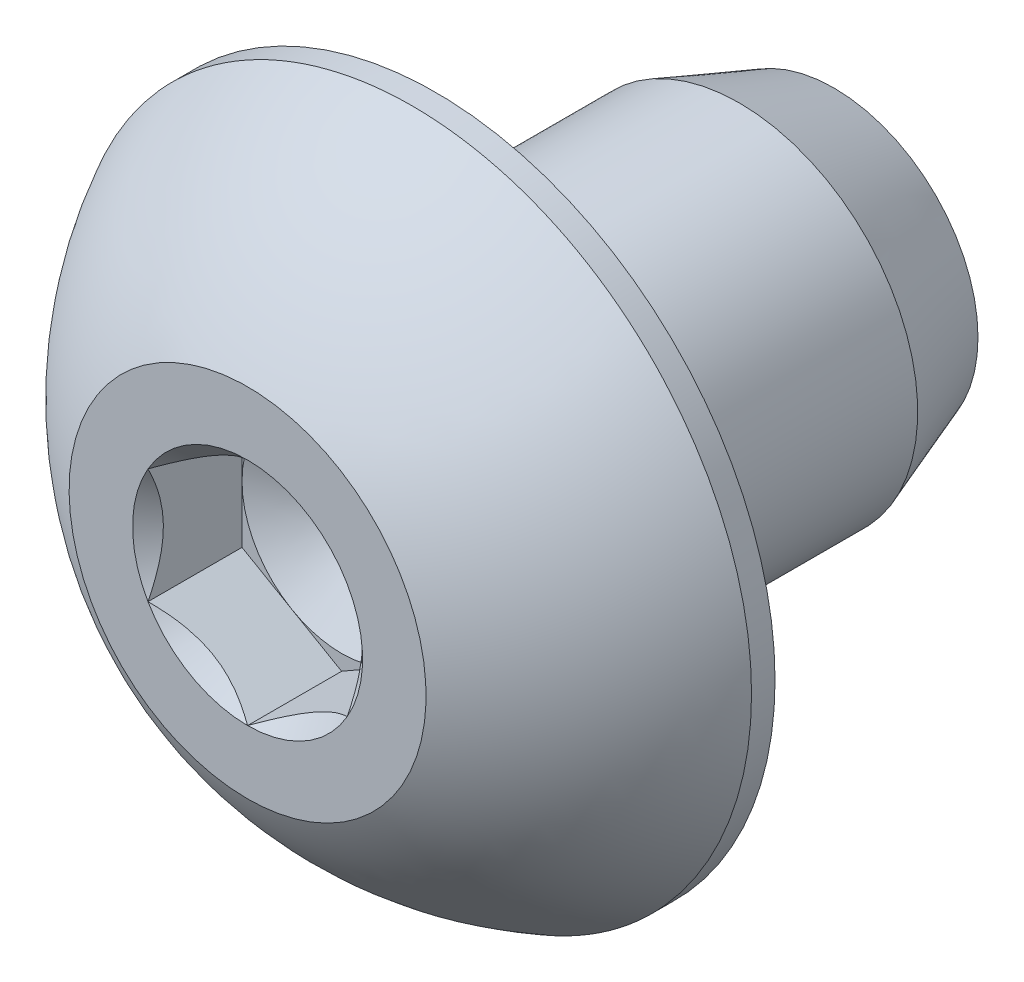
ISO-10303-21;
HEADER;
FILE_DESCRIPTION(('STEP AP214'),'2;1');
FILE_NAME('part.step','',(''),(''),'','','');
FILE_SCHEMA(('AUTOMOTIVE_DESIGN { 1 0 10303 214 1 1 1 1 }'));
ENDSEC;
DATA;
#1=APPLICATION_CONTEXT('core data for automotive mechanical design processes');
#2=APPLICATION_PROTOCOL_DEFINITION('international standard','automotive_design',2000,#1);
#3=PRODUCT_CONTEXT('',#1,'mechanical');
#4=PRODUCT('Part','Part','',(#3));
#5=PRODUCT_RELATED_PRODUCT_CATEGORY('part','',(#4));
#6=PRODUCT_DEFINITION_FORMATION('','',#4);
#7=PRODUCT_DEFINITION_CONTEXT('part definition',#1,'design');
#8=PRODUCT_DEFINITION('design','',#6,#7);
#9=PRODUCT_DEFINITION_SHAPE('','',#8);
#10=(LENGTH_UNIT() NAMED_UNIT(*) SI_UNIT(.MILLI.,.METRE.));
#11=(NAMED_UNIT(*) PLANE_ANGLE_UNIT() SI_UNIT($,.RADIAN.));
#12=(NAMED_UNIT(*) SI_UNIT($,.STERADIAN.) SOLID_ANGLE_UNIT());
#13=UNCERTAINTY_MEASURE_WITH_UNIT(LENGTH_MEASURE(1.E-05),#10,'distance_accuracy_value','');
#14=(GEOMETRIC_REPRESENTATION_CONTEXT(3) GLOBAL_UNCERTAINTY_ASSIGNED_CONTEXT((#13)) GLOBAL_UNIT_ASSIGNED_CONTEXT((#10,
#11,#12)) REPRESENTATION_CONTEXT('',''));
#15=CARTESIAN_POINT('',(0.,0.,0.));
#16=DIRECTION('',(0.,0.,1.));
#17=DIRECTION('',(1.,0.,0.));
#18=AXIS2_PLACEMENT_3D('',#15,#16,#17);
#19=CARTESIAN_POINT('',(0.,0.,0.499533333333333));
#20=DIRECTION('',(0.,0.,1.));
#21=DIRECTION('',(1.,0.,0.));
#22=AXIS2_PLACEMENT_3D('',#19,#20,#21);
#23=PLANE('',#22);
#24=CARTESIAN_POINT('',(0.,0.,0.499533333311319));
#25=DIRECTION('',(0.,0.,1.));
#26=DIRECTION('',(0.,-1.,0.));
#27=AXIS2_PLACEMENT_3D('',#24,#25,#26);
#28=CIRCLE('',#27,0.361141443306678);
#29=CARTESIAN_POINT('',(0.,-0.361141443306678,0.499533333311319));
#30=VERTEX_POINT('',#29);
#31=EDGE_CURVE('E19',#30,#30,#28,.T.);
#32=ORIENTED_EDGE('',*,*,#31,.T.);
#33=EDGE_LOOP('',(#32));
#34=FACE_BOUND('',#33,.T.);
#35=ADVANCED_FACE('F16',(#34),#23,.T.);
#36=CARTESIAN_POINT('',(0.,0.,0.749299999995401));
#37=DIRECTION('',(0.,0.,1.));
#38=DIRECTION('',(0.,-1.,0.));
#39=AXIS2_PLACEMENT_3D('',#36,#37,#38);
#40=CONICAL_SURFACE('',#39,0.793750000070759,1.04719755122676);
#41=ORIENTED_EDGE('',*,*,#31,.F.);
#42=EDGE_LOOP('',(#41));
#43=FACE_BOUND('',#42,.T.);
#44=CARTESIAN_POINT('',(0.,0.,0.749299999995401));
#45=DIRECTION('',(0.,0.,1.));
#46=DIRECTION('',(0.,-1.,0.));
#47=AXIS2_PLACEMENT_3D('',#44,#45,#46);
#48=CIRCLE('',#47,0.793750000070759);
#49=CARTESIAN_POINT('',(0.793750000035379,0.,0.7492999999977));
#50=VERTEX_POINT('',#49);
#51=CARTESIAN_POINT('',(0.39687500001769,-0.68740766428454,0.7492999999977));
#52=VERTEX_POINT('',#51);
#53=EDGE_CURVE('E355',#50,#52,#48,.F.);
#54=ORIENTED_EDGE('',*,*,#53,.F.);
#55=CARTESIAN_POINT('',(0.,0.,0.749299999995401));
#56=DIRECTION('',(0.,0.,1.));
#57=DIRECTION('',(0.,-1.,0.));
#58=AXIS2_PLACEMENT_3D('',#55,#56,#57);
#59=CIRCLE('',#58,0.793750000070759);
#60=CARTESIAN_POINT('',(0.396875000017689,0.687407664284537,0.7492999999977));
#61=VERTEX_POINT('',#60);
#62=EDGE_CURVE('E81',#61,#50,#59,.F.);
#63=ORIENTED_EDGE('',*,*,#62,.F.);
#64=CARTESIAN_POINT('',(0.,0.,0.749299999995401));
#65=DIRECTION('',(0.,0.,1.));
#66=DIRECTION('',(0.,-1.,0.));
#67=AXIS2_PLACEMENT_3D('',#64,#65,#66);
#68=CIRCLE('',#67,0.793750000070759);
#69=CARTESIAN_POINT('',(-0.396875000017689,0.687407664284536,0.7492999999977));
#70=VERTEX_POINT('',#69);
#71=EDGE_CURVE('E75',#70,#61,#68,.F.);
#72=ORIENTED_EDGE('',*,*,#71,.F.);
#73=CARTESIAN_POINT('',(0.,0.,0.749299999995401));
#74=DIRECTION('',(0.,0.,1.));
#75=DIRECTION('',(0.,-1.,0.));
#76=AXIS2_PLACEMENT_3D('',#73,#74,#75);
#77=CIRCLE('',#76,0.793750000070759);
#78=CARTESIAN_POINT('',(-0.79375000003538,0.,0.7492999999977));
#79=VERTEX_POINT('',#78);
#80=EDGE_CURVE('E95',#79,#70,#77,.F.);
#81=ORIENTED_EDGE('',*,*,#80,.F.);
#82=CARTESIAN_POINT('',(0.,0.,0.749299999995401));
#83=DIRECTION('',(0.,0.,1.));
#84=DIRECTION('',(0.,-1.,0.));
#85=AXIS2_PLACEMENT_3D('',#82,#83,#84);
#86=CIRCLE('',#85,0.793750000070758);
#87=CARTESIAN_POINT('',(-0.396875000017691,-0.68740766428454,0.7492999999977));
#88=VERTEX_POINT('',#87);
#89=EDGE_CURVE('E369',#88,#79,#86,.F.);
#90=ORIENTED_EDGE('',*,*,#89,.F.);
#91=CARTESIAN_POINT('',(0.,0.,0.749299999995401));
#92=DIRECTION('',(0.,0.,1.));
#93=DIRECTION('',(0.,-1.,0.));
#94=AXIS2_PLACEMENT_3D('',#91,#92,#93);
#95=CIRCLE('',#94,0.793750000070759);
#96=EDGE_CURVE('E363',#52,#88,#95,.F.);
#97=ORIENTED_EDGE('',*,*,#96,.F.);
#98=EDGE_LOOP('',(#54,#63,#72,#81,#90,#97));
#99=FACE_BOUND('',#98,.T.);
#100=ADVANCED_FACE('F251',(#43,#99),#40,.F.);
#101=CARTESIAN_POINT('',(0.793749999999999,-1.3748153285078,0.7493));
#102=DIRECTION('',(0.,0.,1.));
#103=DIRECTION('',(1.,0.,0.));
#104=AXIS2_PLACEMENT_3D('',#101,#102,#103);
#105=PLANE('',#104);
#106=DIRECTION('',(0.,1.,0.));
#107=VECTOR('',#106,1.);
#108=CARTESIAN_POINT('',(0.793749999999999,-0.458271776169272,0.7493));
#109=LINE('',#108,#107);
#110=CARTESIAN_POINT('',(0.793749999999999,0.458271776169264,0.7493));
#111=VERTEX_POINT('',#110);
#112=EDGE_CURVE('E101',#50,#111,#109,.T.);
#113=ORIENTED_EDGE('',*,*,#112,.T.);
#114=DIRECTION('',(-0.866025403784439,0.5,0.));
#115=VECTOR('',#114,1.);
#116=CARTESIAN_POINT('',(0.793749999999999,0.458271776169264,0.7493));
#117=LINE('',#116,#115);
#118=EDGE_CURVE('E87',#111,#61,#117,.T.);
#119=ORIENTED_EDGE('',*,*,#118,.T.);
#120=ORIENTED_EDGE('',*,*,#62,.T.);
#121=EDGE_LOOP('',(#113,#119,#120));
#122=FACE_BOUND('',#121,.T.);
#123=ADVANCED_FACE('F108',(#122),#105,.T.);
#124=CARTESIAN_POINT('',(0.793749999999999,-1.3748153285078,0.7493));
#125=DIRECTION('',(0.,0.,1.));
#126=DIRECTION('',(1.,0.,0.));
#127=AXIS2_PLACEMENT_3D('',#124,#125,#126);
#128=PLANE('',#127);
#129=DIRECTION('',(0.866025403784439,0.5,0.));
#130=VECTOR('',#129,1.);
#131=CARTESIAN_POINT('',(0.,-0.916543552338537,0.7493));
#132=LINE('',#131,#130);
#133=CARTESIAN_POINT('',(0.793749999999999,-0.458271776169272,0.7493));
#134=VERTEX_POINT('',#133);
#135=EDGE_CURVE('E314',#52,#134,#132,.T.);
#136=ORIENTED_EDGE('',*,*,#135,.T.);
#137=DIRECTION('',(0.,1.,0.));
#138=VECTOR('',#137,1.);
#139=CARTESIAN_POINT('',(0.793749999999999,-0.458271776169272,0.7493));
#140=LINE('',#139,#138);
#141=EDGE_CURVE('E109',#134,#50,#140,.T.);
#142=ORIENTED_EDGE('',*,*,#141,.T.);
#143=ORIENTED_EDGE('',*,*,#53,.T.);
#144=EDGE_LOOP('',(#136,#142,#143));
#145=FACE_BOUND('',#144,.T.);
#146=ADVANCED_FACE('F245',(#145),#128,.T.);
#147=CARTESIAN_POINT('',(0.793749999999999,-1.3748153285078,0.7493));
#148=DIRECTION('',(0.,0.,1.));
#149=DIRECTION('',(1.,0.,0.));
#150=AXIS2_PLACEMENT_3D('',#147,#148,#149);
#151=PLANE('',#150);
#152=DIRECTION('',(0.866025403784439,-0.5,0.));
#153=VECTOR('',#152,1.);
#154=CARTESIAN_POINT('',(-0.793750000000001,-0.458271776169271,0.7493));
#155=LINE('',#154,#153);
#156=CARTESIAN_POINT('',(0.,-0.916543552338536,0.7493));
#157=VERTEX_POINT('',#156);
#158=EDGE_CURVE('E308',#88,#157,#155,.T.);
#159=ORIENTED_EDGE('',*,*,#158,.T.);
#160=DIRECTION('',(0.866025403784439,0.5,0.));
#161=VECTOR('',#160,1.);
#162=CARTESIAN_POINT('',(0.,-0.916543552338537,0.7493));
#163=LINE('',#162,#161);
#164=EDGE_CURVE('E106',#157,#52,#163,.T.);
#165=ORIENTED_EDGE('',*,*,#164,.T.);
#166=ORIENTED_EDGE('',*,*,#96,.T.);
#167=EDGE_LOOP('',(#159,#165,#166));
#168=FACE_BOUND('',#167,.T.);
#169=ADVANCED_FACE('F241',(#168),#151,.T.);
#170=CARTESIAN_POINT('',(0.793749999999999,-1.3748153285078,0.7493));
#171=DIRECTION('',(0.,0.,1.));
#172=DIRECTION('',(1.,0.,0.));
#173=AXIS2_PLACEMENT_3D('',#170,#171,#172);
#174=PLANE('',#173);
#175=DIRECTION('',(0.,1.,0.));
#176=VECTOR('',#175,1.);
#177=CARTESIAN_POINT('',(-0.793750000000001,0.458271776169261,0.7493));
#178=LINE('',#177,#176);
#179=CARTESIAN_POINT('',(-0.793750000000001,-0.458271776169271,0.7493));
#180=VERTEX_POINT('',#179);
#181=EDGE_CURVE('E301',#79,#180,#178,.F.);
#182=ORIENTED_EDGE('',*,*,#181,.T.);
#183=DIRECTION('',(0.866025403784439,-0.5,0.));
#184=VECTOR('',#183,1.);
#185=CARTESIAN_POINT('',(-0.793750000000001,-0.458271776169271,0.7493));
#186=LINE('',#185,#184);
#187=EDGE_CURVE('E313',#180,#88,#186,.T.);
#188=ORIENTED_EDGE('',*,*,#187,.T.);
#189=ORIENTED_EDGE('',*,*,#89,.T.);
#190=EDGE_LOOP('',(#182,#188,#189));
#191=FACE_BOUND('',#190,.T.);
#192=ADVANCED_FACE('F238',(#191),#174,.T.);
#193=CARTESIAN_POINT('',(0.793749999999999,-1.3748153285078,0.7493));
#194=DIRECTION('',(0.,0.,1.));
#195=DIRECTION('',(1.,0.,0.));
#196=AXIS2_PLACEMENT_3D('',#193,#194,#195);
#197=PLANE('',#196);
#198=DIRECTION('',(-0.866025403784439,0.5,0.));
#199=VECTOR('',#198,1.);
#200=CARTESIAN_POINT('',(0.793749999999999,0.458271776169264,0.7493));
#201=LINE('',#200,#199);
#202=CARTESIAN_POINT('',(0.,0.916543552338526,0.7493));
#203=VERTEX_POINT('',#202);
#204=EDGE_CURVE('E94',#61,#203,#201,.T.);
#205=ORIENTED_EDGE('',*,*,#204,.T.);
#206=DIRECTION('',(-0.866025403784438,-0.5,0.));
#207=VECTOR('',#206,1.);
#208=CARTESIAN_POINT('',(0.,0.916543552338528,0.7493));
#209=LINE('',#208,#207);
#210=EDGE_CURVE('E300',#203,#70,#209,.T.);
#211=ORIENTED_EDGE('',*,*,#210,.T.);
#212=ORIENTED_EDGE('',*,*,#71,.T.);
#213=EDGE_LOOP('',(#205,#211,#212));
#214=FACE_BOUND('',#213,.T.);
#215=ADVANCED_FACE('F234',(#214),#197,.T.);
#216=CARTESIAN_POINT('',(0.793749999999999,-1.3748153285078,0.7493));
#217=DIRECTION('',(0.,0.,1.));
#218=DIRECTION('',(1.,0.,0.));
#219=AXIS2_PLACEMENT_3D('',#216,#217,#218);
#220=PLANE('',#219);
#221=DIRECTION('',(-0.866025403784438,-0.5,0.));
#222=VECTOR('',#221,1.);
#223=CARTESIAN_POINT('',(0.,0.916543552338528,0.7493));
#224=LINE('',#223,#222);
#225=CARTESIAN_POINT('',(-0.793750000000001,0.458271776169261,0.7493));
#226=VERTEX_POINT('',#225);
#227=EDGE_CURVE('E294',#70,#226,#224,.T.);
#228=ORIENTED_EDGE('',*,*,#227,.T.);
#229=DIRECTION('',(0.,1.,0.));
#230=VECTOR('',#229,1.);
#231=CARTESIAN_POINT('',(-0.793750000000001,0.458271776169261,0.7493));
#232=LINE('',#231,#230);
#233=EDGE_CURVE('E307',#226,#79,#232,.F.);
#234=ORIENTED_EDGE('',*,*,#233,.T.);
#235=ORIENTED_EDGE('',*,*,#80,.T.);
#236=EDGE_LOOP('',(#228,#234,#235));
#237=FACE_BOUND('',#236,.T.);
#238=ADVANCED_FACE('F231',(#237),#220,.T.);
#239=CARTESIAN_POINT('',(0.793749999999999,0.458271776169264,0.7493));
#240=DIRECTION('',(0.5,0.866025403784439,0.));
#241=DIRECTION('',(-0.866025403784439,0.5,0.));
#242=AXIS2_PLACEMENT_3D('',#239,#240,#241);
#243=PLANE('',#242);
#244=CARTESIAN_POINT('',(0.793749999984981,0.458271776175997,1.49860000001476));
#245=CARTESIAN_POINT('',(0.766468387401486,0.474022822546245,1.48286414413926));
#246=CARTESIAN_POINT('',(0.738730682436422,0.490037193975037,1.46805255795257));
#247=CARTESIAN_POINT('',(0.682170655102864,0.522692140981815,1.44093317103073));
#248=CARTESIAN_POINT('',(0.653342956809629,0.539335820351393,1.42864045455148));
#249=CARTESIAN_POINT('',(0.595213203753814,0.572897048925995,1.40758310076897));
#250=CARTESIAN_POINT('',(0.565925946680102,0.589806054681364,1.39876554808624));
#251=CARTESIAN_POINT('',(0.506707298441107,0.62399595718322,1.38517986145879));
#252=CARTESIAN_POINT('',(0.476777713911571,0.641275810868071,1.38040159196537));
#253=CARTESIAN_POINT('',(0.425189875514825,0.671060063253339,1.3760917397324));
#254=CARTESIAN_POINT('',(0.403598614444802,0.683525783644262,1.37545489995247));
#255=CARTESIAN_POINT('',(0.360457981374222,0.708433039760572,1.37652821886569));
#256=CARTESIAN_POINT('',(0.33890861967972,0.720874569535758,1.37823889600417));
#257=CARTESIAN_POINT('',(0.274568421822292,0.758021400088457,1.38677913492328));
#258=CARTESIAN_POINT('',(0.232097868092202,0.782541785717157,1.39701786578682));
#259=CARTESIAN_POINT('',(0.157588950855752,0.825559529140649,1.42171553387218));
#260=CARTESIAN_POINT('',(0.125199877518035,0.844259369350982,1.43487535892107));
#261=CARTESIAN_POINT('',(0.0616892985520822,0.880927219213364,1.46451739489941));
#262=CARTESIAN_POINT('',(0.0305640531904897,0.898897388001473,1.48098879063839));
#263=CARTESIAN_POINT('',(1.39644451711373E-11,0.916543552330466,1.49860000001396));
#264=B_SPLINE_CURVE_WITH_KNOTS('',3,(#244,#245,#246,#247,#248,#249,#250,#251,#252,#253,#254,
#255,#256,#257,#258,#259,#260,#261,#262,#263),.UNSPECIFIED.,.F.,.F.,(4,2,2,2,2,2,2,2,2,4),(0.,
0.10571396381212,0.212043598466134,0.316685078051546,0.421063200546594,0.49577344029324,
0.570500182331605,0.719996020142865,0.838779765394142,0.957181701199463),.UNSPECIFIED.);
#265=CARTESIAN_POINT('',(0.793749999993069,0.458271776142038,1.49860000000241));
#266=VERTEX_POINT('',#265);
#267=CARTESIAN_POINT('',(0.,0.916543552322913,1.49860000000641));
#268=VERTEX_POINT('',#267);
#269=EDGE_CURVE('E220',#266,#268,#264,.T.);
#270=ORIENTED_EDGE('',*,*,#269,.T.);
#271=DIRECTION('',(0.,0.,1.));
#272=VECTOR('',#271,1.);
#273=CARTESIAN_POINT('',(0.,0.916543552338524,0.7493));
#274=LINE('',#273,#272);
#275=EDGE_CURVE('E288',#268,#203,#274,.F.);
#276=ORIENTED_EDGE('',*,*,#275,.T.);
#277=ORIENTED_EDGE('',*,*,#204,.F.);
#278=ORIENTED_EDGE('',*,*,#118,.F.);
#279=DIRECTION('',(0.,0.,-1.));
#280=VECTOR('',#279,1.);
#281=CARTESIAN_POINT('',(0.793749999999999,0.458271776169264,0.7493));
#282=LINE('',#281,#280);
#283=EDGE_CURVE('E91',#111,#266,#282,.F.);
#284=ORIENTED_EDGE('',*,*,#283,.T.);
#285=EDGE_LOOP('',(#270,#276,#277,#278,#284));
#286=FACE_BOUND('',#285,.T.);
#287=ADVANCED_FACE('F90',(#286),#243,.F.);
#288=CARTESIAN_POINT('',(0.793749999999999,-0.458271776169272,0.7493));
#289=DIRECTION('',(1.,0.,0.));
#290=DIRECTION('',(0.,0.,-1.));
#291=AXIS2_PLACEMENT_3D('',#288,#289,#290);
#292=PLANE('',#291);
#293=CARTESIAN_POINT('',(0.793749999998316,-0.458271776152903,1.49860000001477));
#294=CARTESIAN_POINT('',(0.793749999999393,-0.426975491049293,1.48296651779682));
#295=CARTESIAN_POINT('',(0.793749999999837,-0.39515931237104,1.46824581300037));
#296=CARTESIAN_POINT('',(0.793750000000163,-0.330270832110431,1.44126245966619));
#297=CARTESIAN_POINT('',(0.793750000000043,-0.297191783713648,1.42901617939526));
#298=CARTESIAN_POINT('',(0.793749999999956,-0.230077553253918,1.40786961389565));
#299=CARTESIAN_POINT('',(0.793749999999988,-0.196046036720344,1.39895800475126));
#300=CARTESIAN_POINT('',(0.793750000000011,-0.127237343113491,1.38523771300879));
#301=CARTESIAN_POINT('',(0.793750000000001,-0.0924628174584713,1.38041634273154));
#302=CARTESIAN_POINT('',(0.793749999999999,-0.0479673001822662,1.37719659968676));
#303=CARTESIAN_POINT('',(0.793749999999999,-0.0383784693408378,1.37667618275069));
#304=CARTESIAN_POINT('',(0.793749999999999,-0.0191940940646776,1.37598033825731));
#305=CARTESIAN_POINT('',(0.793749999999999,-0.00959855611422884,1.37580472329213));
#306=CARTESIAN_POINT('',(0.793749999999999,0.0481505552443495,1.37581509798472));
#307=CARTESIAN_POINT('',(0.793749999999999,0.0963770615083965,1.38028642997643));
#308=CARTESIAN_POINT('',(0.793749999999999,0.191553320403348,1.39722654668576));
#309=CARTESIAN_POINT('',(0.793749999999999,0.238494653341624,1.40973891227007));
#310=CARTESIAN_POINT('',(0.793749999999999,0.314361329209395,1.43532182934164));
#311=CARTESIAN_POINT('',(0.793749999999999,0.343890227735906,1.4466947344021));
#312=CARTESIAN_POINT('',(0.793749999999999,0.401829965141459,1.47134366658123));
#313=CARTESIAN_POINT('',(0.793749999999999,0.430248560019513,1.48460133532251));
#314=CARTESIAN_POINT('',(0.793749999999999,0.458271776153172,1.49860000001398));
#315=B_SPLINE_CURVE_WITH_KNOTS('',3,(#293,#294,#295,#296,#297,#298,#299,#300,#301,#302,#303,
#304,#305,#306,#307,#308,#309,#310,#311,#312,#313,#314),.UNSPECIFIED.,.F.,.F.,(4,2,2,2,2,2,2,2,
2,2,4),(0.,0.105023602064034,0.210720694297195,0.316055529705702,0.421062415372318,
0.449866476680361,0.478654877974874,0.623070089013118,0.768274680513024,0.863134860534031,
0.957127400492166),.UNSPECIFIED.);
#316=CARTESIAN_POINT('',(0.793749999972953,-0.458271776176887,1.49860000000242));
#317=VERTEX_POINT('',#316);
#318=EDGE_CURVE('E104',#317,#266,#315,.T.);
#319=ORIENTED_EDGE('',*,*,#318,.T.);
#320=ORIENTED_EDGE('',*,*,#283,.F.);
#321=ORIENTED_EDGE('',*,*,#112,.F.);
#322=ORIENTED_EDGE('',*,*,#141,.F.);
#323=DIRECTION('',(0.,0.,1.));
#324=VECTOR('',#323,1.);
#325=CARTESIAN_POINT('',(0.793749999999999,-0.458271776169272,0.7493));
#326=LINE('',#325,#324);
#327=EDGE_CURVE('E311',#134,#317,#326,.T.);
#328=ORIENTED_EDGE('',*,*,#327,.T.);
#329=EDGE_LOOP('',(#319,#320,#321,#322,#328));
#330=FACE_BOUND('',#329,.T.);
#331=ADVANCED_FACE('F99',(#330),#292,.F.);
#332=CARTESIAN_POINT('',(0.,-0.916543552338537,0.7493));
#333=DIRECTION('',(0.5,-0.866025403784439,0.));
#334=DIRECTION('',(0.866025403784439,0.5,0.));
#335=AXIS2_PLACEMENT_3D('',#332,#333,#334);
#336=PLANE('',#335);
#337=CARTESIAN_POINT('',(1.33355930979855E-11,-0.916543552328894,1.49860000001477));
#338=CARTESIAN_POINT('',(0.0272816125979058,-0.900792505960509,1.48286414413926));
#339=CARTESIAN_POINT('',(0.0550193175634121,-0.884778134532483,1.46805255795258));
#340=CARTESIAN_POINT('',(0.111579344897296,-0.852123187526269,1.44093317103074));
#341=CARTESIAN_POINT('',(0.140407043190412,-0.835479508156483,1.42864045455149));
#342=CARTESIAN_POINT('',(0.19853679624614,-0.801918279581732,1.40758310076898));
#343=CARTESIAN_POINT('',(0.227824053319883,-0.785009273826417,1.39876554808625));
#344=CARTESIAN_POINT('',(0.287042701558901,-0.750819371324601,1.3851798614588));
#345=CARTESIAN_POINT('',(0.316972286088428,-0.733539517639734,1.38040159196538));
#346=CARTESIAN_POINT('',(0.368560124485171,-0.703755265254459,1.37609173973241));
#347=CARTESIAN_POINT('',(0.390151385555195,-0.691289544863538,1.37545489995248));
#348=CARTESIAN_POINT('',(0.433292018625776,-0.666382288747229,1.3765282188657));
#349=CARTESIAN_POINT('',(0.454841380320279,-0.653940758972043,1.37823889600418));
#350=CARTESIAN_POINT('',(0.519181578177706,-0.616793928419343,1.38677913492328));
#351=CARTESIAN_POINT('',(0.561652131907797,-0.592273542790643,1.39701786578682));
#352=CARTESIAN_POINT('',(0.636161049144245,-0.549255799367152,1.42171553387219));
#353=CARTESIAN_POINT('',(0.66855012248196,-0.53055595915682,1.43487535892108));
#354=CARTESIAN_POINT('',(0.732060701447909,-0.49388810929444,1.46451739489941));
#355=CARTESIAN_POINT('',(0.7631859468095,-0.475917940506332,1.48098879063839));
#356=CARTESIAN_POINT('',(0.793749999986024,-0.458271776177341,1.49860000001396));
#357=B_SPLINE_CURVE_WITH_KNOTS('',3,(#337,#338,#339,#340,#341,#342,#343,#344,#345,#346,#347,
#348,#349,#350,#351,#352,#353,#354,#355,#356),.UNSPECIFIED.,.F.,.F.,(4,2,2,2,2,2,2,2,2,4),(0.,
0.105713963812121,0.212043598466135,0.316685078051547,0.421063200546596,0.495773440293243,
0.570500182331608,0.719996020142868,0.838779765394138,0.957181701199452),.UNSPECIFIED.);
#358=CARTESIAN_POINT('',(-2.01206942672553E-11,-0.916543552318919,1.49860000000242));
#359=VERTEX_POINT('',#358);
#360=EDGE_CURVE('E198',#359,#317,#357,.T.);
#361=ORIENTED_EDGE('',*,*,#360,.T.);
#362=ORIENTED_EDGE('',*,*,#327,.F.);
#363=ORIENTED_EDGE('',*,*,#135,.F.);
#364=ORIENTED_EDGE('',*,*,#164,.F.);
#365=DIRECTION('',(0.,0.,1.));
#366=VECTOR('',#365,1.);
#367=CARTESIAN_POINT('',(0.,-0.916543552338536,0.7493));
#368=LINE('',#367,#366);
#369=EDGE_CURVE('E304',#157,#359,#368,.T.);
#370=ORIENTED_EDGE('',*,*,#369,.T.);
#371=EDGE_LOOP('',(#361,#362,#363,#364,#370));
#372=FACE_BOUND('',#371,.T.);
#373=ADVANCED_FACE('F188',(#372),#336,.F.);
#374=CARTESIAN_POINT('',(-0.793750000000001,-0.458271776169271,0.7493));
#375=DIRECTION('',(-0.5,-0.866025403784439,0.));
#376=DIRECTION('',(0.866025403784439,-0.5,0.));
#377=AXIS2_PLACEMENT_3D('',#374,#375,#376);
#378=PLANE('',#377);
#379=CARTESIAN_POINT('',(-0.793749999984982,-0.458271776176001,1.49860000001477));
#380=CARTESIAN_POINT('',(-0.766468387401489,-0.474022822546251,1.48286414413926));
#381=CARTESIAN_POINT('',(-0.738730682436426,-0.490037193975043,1.46805255795258));
#382=CARTESIAN_POINT('',(-0.682170655102868,-0.522692140981822,1.44093317103074));
#383=CARTESIAN_POINT('',(-0.653342956809633,-0.5393358203514,1.42864045455149));
#384=CARTESIAN_POINT('',(-0.595213203753818,-0.572897048926001,1.40758310076898));
#385=CARTESIAN_POINT('',(-0.565925946680107,-0.589806054681371,1.39876554808625));
#386=CARTESIAN_POINT('',(-0.506707298441112,-0.623995957183226,1.3851798614588));
#387=CARTESIAN_POINT('',(-0.476777713911577,-0.641275810868077,1.38040159196538));
#388=CARTESIAN_POINT('',(-0.42518987551483,-0.671060063253345,1.37609173973241));
#389=CARTESIAN_POINT('',(-0.403598614444807,-0.683525783644267,1.37545489995248));
#390=CARTESIAN_POINT('',(-0.360457981374227,-0.708433039760579,1.3765282188657));
#391=CARTESIAN_POINT('',(-0.338908619679724,-0.720874569535764,1.37823889600418));
#392=CARTESIAN_POINT('',(-0.274568421822296,-0.758021400088463,1.38677913492329));
#393=CARTESIAN_POINT('',(-0.232097868092206,-0.782541785717164,1.39701786578682));
#394=CARTESIAN_POINT('',(-0.157588950855757,-0.825559529140655,1.42171553387219));
#395=CARTESIAN_POINT('',(-0.125199877518042,-0.844259369350987,1.43487535892108));
#396=CARTESIAN_POINT('',(-0.0616892985520926,-0.880927219213367,1.46451739489941));
#397=CARTESIAN_POINT('',(-0.0305640531905017,-0.898897388001475,1.48098879063839));
#398=CARTESIAN_POINT('',(-1.39777830432795E-11,-0.916543552330467,1.49860000001397));
#399=B_SPLINE_CURVE_WITH_KNOTS('',3,(#379,#380,#381,#382,#383,#384,#385,#386,#387,#388,#389,
#390,#391,#392,#393,#394,#395,#396,#397,#398),.UNSPECIFIED.,.F.,.F.,(4,2,2,2,2,2,2,2,2,4),(0.,
0.10571396381212,0.212043598466133,0.316685078051544,0.421063200546592,0.495773440293239,
0.570500182331604,0.719996020142865,0.838779765394135,0.95718170119945),.UNSPECIFIED.);
#400=CARTESIAN_POINT('',(-0.793749999993072,-0.45827177614204,1.49860000000242));
#401=VERTEX_POINT('',#400);
#402=EDGE_CURVE('E192',#401,#359,#399,.T.);
#403=ORIENTED_EDGE('',*,*,#402,.T.);
#404=ORIENTED_EDGE('',*,*,#369,.F.);
#405=ORIENTED_EDGE('',*,*,#158,.F.);
#406=ORIENTED_EDGE('',*,*,#187,.F.);
#407=DIRECTION('',(0.,0.,1.));
#408=VECTOR('',#407,1.);
#409=CARTESIAN_POINT('',(-0.793750000000001,-0.458271776169271,0.7493));
#410=LINE('',#409,#408);
#411=EDGE_CURVE('E297',#180,#401,#410,.T.);
#412=ORIENTED_EDGE('',*,*,#411,.T.);
#413=EDGE_LOOP('',(#403,#404,#405,#406,#412));
#414=FACE_BOUND('',#413,.T.);
#415=ADVANCED_FACE('F183',(#414),#378,.F.);
#416=CARTESIAN_POINT('',(-0.793750000000001,0.458271776169261,0.7493));
#417=DIRECTION('',(-1.,0.,0.));
#418=DIRECTION('',(0.,0.,1.));
#419=AXIS2_PLACEMENT_3D('',#416,#417,#418);
#420=PLANE('',#419);
#421=CARTESIAN_POINT('',(-0.793749999998323,0.458271776152889,1.49860000001476));
#422=CARTESIAN_POINT('',(-0.793749999999397,0.426769683414265,1.48286414413926));
#423=CARTESIAN_POINT('',(-0.793749999999839,0.394740940557458,1.46805255795257));
#424=CARTESIAN_POINT('',(-0.793750000000164,0.329431046544489,1.44093317103073));
#425=CARTESIAN_POINT('',(-0.793750000000044,0.296143687805137,1.42864045455148));
#426=CARTESIAN_POINT('',(-0.793749999999958,0.229021230655807,1.40758310076896));
#427=CARTESIAN_POINT('',(-0.79374999999999,0.195203219145135,1.39876554808622));
#428=CARTESIAN_POINT('',(-0.793750000000012,0.126823414141485,1.38517986145877));
#429=CARTESIAN_POINT('',(-0.793750000000004,0.092263706771778,1.38040159196534));
#430=CARTESIAN_POINT('',(-0.793749999999999,0.0326952020012599,1.37609173973236));
#431=CARTESIAN_POINT('',(-0.793750000000001,0.00776376121943092,1.37545489995242));
#432=CARTESIAN_POINT('',(-0.793750000000002,-0.0420507510131619,1.37652821886563));
#433=CARTESIAN_POINT('',(-0.793750000000001,-0.0669338105635199,1.37823889600411));
#434=CARTESIAN_POINT('',(-0.793750000000001,-0.141227471668879,1.38677913492319));
#435=CARTESIAN_POINT('',(-0.793750000000001,-0.190268242926254,1.39701786578672));
#436=CARTESIAN_POINT('',(-0.793750000000001,-0.276303729773267,1.42171553387207));
#437=CARTESIAN_POINT('',(-0.793750000000001,-0.313703410193983,1.43487535892098));
#438=CARTESIAN_POINT('',(-0.793750000000001,-0.387039109918843,1.46451739489936));
#439=CARTESIAN_POINT('',(-0.793750000000001,-0.422979447495106,1.48098879063836));
#440=CARTESIAN_POINT('',(-0.793750000000001,-0.458271776153135,1.49860000001397));
#441=B_SPLINE_CURVE_WITH_KNOTS('',3,(#421,#422,#423,#424,#425,#426,#427,#428,#429,#430,#431,
#432,#433,#434,#435,#436,#437,#438,#439,#440),.UNSPECIFIED.,.F.,.F.,(4,2,2,2,2,2,2,2,2,4),(0.,
0.105713963812089,0.212043598466072,0.316685078051454,0.421063200546472,0.495773440293077,
0.5705001823314,0.719996020142576,0.838779765394009,0.957181701199487),.UNSPECIFIED.);
#442=CARTESIAN_POINT('',(-0.793749999972958,0.458271776176872,1.49860000000241));
#443=VERTEX_POINT('',#442);
#444=EDGE_CURVE('E33',#443,#401,#441,.T.);
#445=ORIENTED_EDGE('',*,*,#444,.T.);
#446=ORIENTED_EDGE('',*,*,#411,.F.);
#447=ORIENTED_EDGE('',*,*,#181,.F.);
#448=ORIENTED_EDGE('',*,*,#233,.F.);
#449=DIRECTION('',(0.,0.,1.));
#450=VECTOR('',#449,1.);
#451=CARTESIAN_POINT('',(-0.793750000000001,0.458271776169261,0.7493));
#452=LINE('',#451,#450);
#453=EDGE_CURVE('E290',#226,#443,#452,.T.);
#454=ORIENTED_EDGE('',*,*,#453,.T.);
#455=EDGE_LOOP('',(#445,#446,#447,#448,#454));
#456=FACE_BOUND('',#455,.T.);
#457=ADVANCED_FACE('F176',(#456),#420,.F.);
#458=CARTESIAN_POINT('',(0.,0.916543552338528,0.7493));
#459=DIRECTION('',(-0.5,0.866025403784438,0.));
#460=DIRECTION('',(-0.866025403784438,-0.5,0.));
#461=AXIS2_PLACEMENT_3D('',#458,#459,#460);
#462=PLANE('',#461);
#463=CARTESIAN_POINT('',(-1.33406651125811E-11,0.916543552328888,1.49860000001476));
#464=CARTESIAN_POINT('',(-0.0272816125979096,0.9007925059605,1.48286414413925));
#465=CARTESIAN_POINT('',(-0.0550193175634151,0.884778134532473,1.46805255795257));
#466=CARTESIAN_POINT('',(-0.111579344897298,0.852123187526259,1.44093317103073));
#467=CARTESIAN_POINT('',(-0.140407043190413,0.835479508156473,1.42864045455148));
#468=CARTESIAN_POINT('',(-0.198536796246142,0.801918279581722,1.40758310076897));
#469=CARTESIAN_POINT('',(-0.227824053319884,0.785009273826408,1.39876554808624));
#470=CARTESIAN_POINT('',(-0.287042701558902,0.750819371324591,1.38517986145879));
#471=CARTESIAN_POINT('',(-0.316972286088429,0.733539517639725,1.38040159196537));
#472=CARTESIAN_POINT('',(-0.368560124485171,0.70375526525445,1.3760917397324));
#473=CARTESIAN_POINT('',(-0.390151385555195,0.69128954486353,1.37545489995247));
#474=CARTESIAN_POINT('',(-0.433292018625775,0.66638228874722,1.37652821886569));
#475=CARTESIAN_POINT('',(-0.454841380320278,0.653940758972034,1.37823889600417));
#476=CARTESIAN_POINT('',(-0.519181578177704,0.616793928419335,1.38677913492328));
#477=CARTESIAN_POINT('',(-0.561652131907795,0.592273542790635,1.39701786578682));
#478=CARTESIAN_POINT('',(-0.636161049144246,0.549255799367142,1.42171553387218));
#479=CARTESIAN_POINT('',(-0.668550122481962,0.530555959156809,1.43487535892107));
#480=CARTESIAN_POINT('',(-0.732060701447916,0.493888109294426,1.46451739489941));
#481=CARTESIAN_POINT('',(-0.763185946809509,0.475917940506318,1.48098879063839));
#482=CARTESIAN_POINT('',(-0.793749999986035,0.458271776177325,1.49860000001396));
#483=B_SPLINE_CURVE_WITH_KNOTS('',3,(#463,#464,#465,#466,#467,#468,#469,#470,#471,#472,#473,
#474,#475,#476,#477,#478,#479,#480,#481,#482),.UNSPECIFIED.,.F.,.F.,(4,2,2,2,2,2,2,2,2,4),(0.,
0.10571396381212,0.212043598466133,0.316685078051544,0.421063200546591,0.495773440293238,
0.570500182331602,0.719996020142862,0.838779765394141,0.957181701199463),.UNSPECIFIED.);
#484=EDGE_CURVE('E156',#268,#443,#483,.T.);
#485=ORIENTED_EDGE('',*,*,#484,.T.);
#486=ORIENTED_EDGE('',*,*,#453,.F.);
#487=ORIENTED_EDGE('',*,*,#227,.F.);
#488=ORIENTED_EDGE('',*,*,#210,.F.);
#489=ORIENTED_EDGE('',*,*,#275,.F.);
#490=EDGE_LOOP('',(#485,#486,#487,#488,#489));
#491=FACE_BOUND('',#490,.T.);
#492=ADVANCED_FACE('F171',(#491),#462,.F.);
#493=CARTESIAN_POINT('',(0.,0.,1.49859999993396));
#494=DIRECTION('',(0.,0.,1.));
#495=DIRECTION('',(1.,0.,0.));
#496=AXIS2_PLACEMENT_3D('',#493,#494,#495);
#497=CONICAL_SURFACE('',#496,0.916543552250459,0.785398163167608);
#498=ORIENTED_EDGE('',*,*,#269,.F.);
#499=CARTESIAN_POINT('',(0.,0.,1.4985999999908));
#500=DIRECTION('',(0.,0.,1.));
#501=DIRECTION('',(1.,0.,0.));
#502=AXIS2_PLACEMENT_3D('',#499,#500,#501);
#503=CIRCLE('',#502,0.916543552307303);
#504=EDGE_CURVE('E164',#268,#266,#503,.F.);
#505=ORIENTED_EDGE('',*,*,#504,.F.);
#506=EDGE_LOOP('',(#498,#505));
#507=FACE_BOUND('',#506,.T.);
#508=ADVANCED_FACE('F175',(#507),#497,.F.);
#509=CARTESIAN_POINT('',(0.,0.,1.49859999993396));
#510=DIRECTION('',(0.,0.,1.));
#511=DIRECTION('',(1.,0.,0.));
#512=AXIS2_PLACEMENT_3D('',#509,#510,#511);
#513=CONICAL_SURFACE('',#512,0.916543552250459,0.785398163397448);
#514=ORIENTED_EDGE('',*,*,#318,.F.);
#515=CARTESIAN_POINT('',(0.,0.,1.4985999999908));
#516=DIRECTION('',(0.,0.,1.));
#517=DIRECTION('',(1.,0.,0.));
#518=AXIS2_PLACEMENT_3D('',#515,#516,#517);
#519=CIRCLE('',#518,0.916543552307303);
#520=EDGE_CURVE('E395',#266,#317,#519,.F.);
#521=ORIENTED_EDGE('',*,*,#520,.F.);
#522=EDGE_LOOP('',(#514,#521));
#523=FACE_BOUND('',#522,.T.);
#524=ADVANCED_FACE('F211',(#523),#513,.F.);
#525=CARTESIAN_POINT('',(0.,0.,1.49859999993396));
#526=DIRECTION('',(0.,0.,1.));
#527=DIRECTION('',(1.,0.,0.));
#528=AXIS2_PLACEMENT_3D('',#525,#526,#527);
#529=CONICAL_SURFACE('',#528,0.916543552250459,0.785398163167608);
#530=ORIENTED_EDGE('',*,*,#360,.F.);
#531=CARTESIAN_POINT('',(0.,0.,1.4985999999908));
#532=DIRECTION('',(0.,0.,1.));
#533=DIRECTION('',(1.,0.,0.));
#534=AXIS2_PLACEMENT_3D('',#531,#532,#533);
#535=CIRCLE('',#534,0.916543552307303);
#536=EDGE_CURVE('E393',#317,#359,#535,.F.);
#537=ORIENTED_EDGE('',*,*,#536,.F.);
#538=EDGE_LOOP('',(#530,#537));
#539=FACE_BOUND('',#538,.T.);
#540=ADVANCED_FACE('F207',(#539),#529,.F.);
#541=CARTESIAN_POINT('',(0.,0.,1.49859999993396));
#542=DIRECTION('',(0.,0.,1.));
#543=DIRECTION('',(1.,0.,0.));
#544=AXIS2_PLACEMENT_3D('',#541,#542,#543);
#545=CONICAL_SURFACE('',#544,0.916543552250459,0.785398163167608);
#546=ORIENTED_EDGE('',*,*,#402,.F.);
#547=CARTESIAN_POINT('',(0.,0.,1.4985999999908));
#548=DIRECTION('',(0.,0.,1.));
#549=DIRECTION('',(1.,0.,0.));
#550=AXIS2_PLACEMENT_3D('',#547,#548,#549);
#551=CIRCLE('',#550,0.916543552307303);
#552=EDGE_CURVE('E388',#359,#401,#551,.F.);
#553=ORIENTED_EDGE('',*,*,#552,.F.);
#554=EDGE_LOOP('',(#546,#553));
#555=FACE_BOUND('',#554,.T.);
#556=ADVANCED_FACE('F204',(#555),#545,.F.);
#557=CARTESIAN_POINT('',(0.,0.,1.49859999993396));
#558=DIRECTION('',(0.,0.,1.));
#559=DIRECTION('',(1.,0.,0.));
#560=AXIS2_PLACEMENT_3D('',#557,#558,#559);
#561=CONICAL_SURFACE('',#560,0.916543552250459,0.785398163167394);
#562=ORIENTED_EDGE('',*,*,#444,.F.);
#563=CARTESIAN_POINT('',(0.,0.,1.4985999999908));
#564=DIRECTION('',(0.,0.,1.));
#565=DIRECTION('',(1.,0.,0.));
#566=AXIS2_PLACEMENT_3D('',#563,#564,#565);
#567=CIRCLE('',#566,0.916543552307303);
#568=EDGE_CURVE('E386',#401,#443,#567,.F.);
#569=ORIENTED_EDGE('',*,*,#568,.F.);
#570=EDGE_LOOP('',(#562,#569));
#571=FACE_BOUND('',#570,.T.);
#572=ADVANCED_FACE('F151',(#571),#561,.F.);
#573=CARTESIAN_POINT('',(0.,0.,1.49859999993396));
#574=DIRECTION('',(0.,0.,1.));
#575=DIRECTION('',(1.,0.,0.));
#576=AXIS2_PLACEMENT_3D('',#573,#574,#575);
#577=CONICAL_SURFACE('',#576,0.916543552250459,0.785398163167608);
#578=ORIENTED_EDGE('',*,*,#484,.F.);
#579=CARTESIAN_POINT('',(0.,0.,1.4985999999908));
#580=DIRECTION('',(0.,0.,1.));
#581=DIRECTION('',(1.,0.,0.));
#582=AXIS2_PLACEMENT_3D('',#579,#580,#581);
#583=CIRCLE('',#582,0.916543552307303);
#584=EDGE_CURVE('E382',#443,#268,#583,.F.);
#585=ORIENTED_EDGE('',*,*,#584,.F.);
#586=EDGE_LOOP('',(#578,#585));
#587=FACE_BOUND('',#586,.T.);
#588=ADVANCED_FACE('F146',(#587),#577,.F.);
#589=CARTESIAN_POINT('',(0.,0.,-3.175));
#590=DIRECTION('',(0.,0.,-1.));
#591=DIRECTION('',(0.,1.,0.));
#592=AXIS2_PLACEMENT_3D('',#589,#590,#591);
#593=PLANE('',#592);
#594=CARTESIAN_POINT('',(0.,0.,-3.17499999999882));
#595=DIRECTION('',(0.,0.,1.));
#596=DIRECTION('',(0.,-1.,0.));
#597=AXIS2_PLACEMENT_3D('',#594,#595,#596);
#598=CIRCLE('',#597,1.14747368445227);
#599=CARTESIAN_POINT('',(0.,-1.14747368445227,-3.17499999999882));
#600=VERTEX_POINT('',#599);
#601=EDGE_CURVE('E130',#600,#600,#598,.T.);
#602=ORIENTED_EDGE('',*,*,#601,.F.);
#603=EDGE_LOOP('',(#602));
#604=FACE_BOUND('',#603,.T.);
#605=ADVANCED_FACE('F142',(#604),#593,.T.);
#606=CARTESIAN_POINT('',(0.,0.,1.4986));
#607=DIRECTION('',(0.,0.,1.));
#608=DIRECTION('',(1.,0.,0.));
#609=AXIS2_PLACEMENT_3D('',#606,#607,#608);
#610=PLANE('',#609);
#611=CARTESIAN_POINT('',(0.,-1.4224,1.4986));
#612=CARTESIAN_POINT('',(-0.0798374015068039,-1.42239547960122,1.49859999999984));
#613=CARTESIAN_POINT('',(-0.159816890979208,-1.41564125649136,1.49859999999987));
#614=CARTESIAN_POINT('',(-0.278015341078682,-1.39554324162256,1.49860000000006));
#615=CARTESIAN_POINT('',(-0.317169786053096,-1.38716526414384,1.49860000000016));
#616=CARTESIAN_POINT('',(-0.394672406919858,-1.36713459799427,1.49859999999984));
#617=CARTESIAN_POINT('',(-0.433019901263238,-1.3554792518748,1.49859999999944));
#618=CARTESIAN_POINT('',(-0.546247055408398,-1.31575749798253,1.49859999999908));
#619=CARTESIAN_POINT('',(-0.619501966382148,-1.28290274979833,1.49859999999996));
#620=CARTESIAN_POINT('',(-0.759450382596394,-1.20534511953095,1.49860000000004));
#621=CARTESIAN_POINT('',(-0.826143638277828,-1.1606417870499,1.49859999999925));
#622=CARTESIAN_POINT('',(-0.919813661930281,-1.08571189888457,1.49859999999953));
#623=CARTESIAN_POINT('',(-0.949993006028799,-1.05940300307192,1.49859999999986));
#624=CARTESIAN_POINT('',(-1.00800204913133,-1.00436597738277,1.49860000000014));
#625=CARTESIAN_POINT('',(-1.0358339854928,-0.975640204468673,1.49860000000008));
#626=CARTESIAN_POINT('',(-1.11556504917461,-0.886067212807743,1.49859999999985));
#627=CARTESIAN_POINT('',(-1.16371969226267,-0.821808081017768,1.49859999999964));
#628=CARTESIAN_POINT('',(-1.24852874079768,-0.686152308566823,1.4985999999997));
#629=CARTESIAN_POINT('',(-1.28518357988482,-0.614755937174258,1.49859999999997));
#630=CARTESIAN_POINT('',(-1.34599329626744,-0.466814812468528,1.49860000000003));
#631=CARTESIAN_POINT('',(-1.3701483070669,-0.390270114151764,1.49859999999984));
#632=CARTESIAN_POINT('',(-1.40526284596797,-0.234213649950167,1.49859999999981));
#633=CARTESIAN_POINT('',(-1.41622230359971,-0.154701868222187,1.49859999999998));
#634=CARTESIAN_POINT('',(-1.42463783082892,0.00503311191649894,1.49860000000002));
#635=CARTESIAN_POINT('',(-1.42209390042638,0.0852563103272047,1.49859999999989));
#636=CARTESIAN_POINT('',(-1.40357169195068,0.244138589560951,1.49859999999988));
#637=CARTESIAN_POINT('',(-1.38759348562201,0.322797678734673,1.49859999999999));
#638=CARTESIAN_POINT('',(-1.34266561054542,0.476309515499143,1.49860000000001));
#639=CARTESIAN_POINT('',(-1.31371580325373,0.551162222426139,1.49859999999991));
#640=CARTESIAN_POINT('',(-1.24363054657928,0.694978494487188,1.49859999999988));
#641=CARTESIAN_POINT('',(-1.20249463766302,0.763941837409078,1.49859999999996));
#642=CARTESIAN_POINT('',(-1.132617015855,0.861396859451879,1.49860000000002));
#643=CARTESIAN_POINT('',(-1.10795757154423,0.892888104543536,1.49860000000004));
#644=CARTESIAN_POINT('',(-1.05605278474118,0.953715864532665,1.49859999999996));
#645=CARTESIAN_POINT('',(-1.0288049696148,0.983050270610388,1.49859999999988));
#646=CARTESIAN_POINT('',(-0.943526899757092,1.06740791562789,1.49859999999982));
#647=CARTESIAN_POINT('',(-0.881900142255507,1.1188716994779,1.49860000000005));
#648=CARTESIAN_POINT('',(-0.750875987896355,1.21070533268511,1.49859999999995));
#649=CARTESIAN_POINT('',(-0.681478886542759,1.25107560372392,1.49859999999962));
#650=CARTESIAN_POINT('',(-0.573052388771753,1.30247502735155,1.49859999999976));
#651=CARTESIAN_POINT('',(-0.536141890999551,1.31809528886646,1.49859999999991));
#652=CARTESIAN_POINT('',(-0.461173079066015,1.34615880726507,1.49860000000009));
#653=CARTESIAN_POINT('',(-0.423115721917291,1.35860463527091,1.49860000000012));
#654=CARTESIAN_POINT('',(-0.307683445892079,1.39101132376674,1.49859999999975));
#655=CARTESIAN_POINT('',(-0.228856428731029,1.40613215812132,1.49859999999889));
#656=CARTESIAN_POINT('',(-0.124634287079547,1.4171504345333,1.49859999999958));
#657=CARTESIAN_POINT('',(-0.0997515641569314,1.41911732246,1.49859999999988));
#658=CARTESIAN_POINT('',(-0.0499171921482095,1.42174281196867,1.49860000000012));
#659=CARTESIAN_POINT('',(-0.0249655430621036,1.42240141355064,1.49860000000005));
#660=CARTESIAN_POINT('',(0.0798374015068042,1.42239547960122,1.49859999999984));
#661=CARTESIAN_POINT('',(0.159816890979208,1.41564125649136,1.49859999999987));
#662=CARTESIAN_POINT('',(0.278015341078683,1.39554324162256,1.49860000000006));
#663=CARTESIAN_POINT('',(0.317169786053097,1.38716526414384,1.49860000000016));
#664=CARTESIAN_POINT('',(0.394672406919859,1.36713459799427,1.49859999999984));
#665=CARTESIAN_POINT('',(0.433019901263239,1.3554792518748,1.49859999999944));
#666=CARTESIAN_POINT('',(0.546247055408399,1.31575749798253,1.49859999999908));
#667=CARTESIAN_POINT('',(0.619501966382149,1.28290274979833,1.49859999999996));
#668=CARTESIAN_POINT('',(0.759450382596395,1.20534511953094,1.49860000000004));
#669=CARTESIAN_POINT('',(0.826143638277829,1.1606417870499,1.49859999999925));
#670=CARTESIAN_POINT('',(0.919813661930282,1.08571189888457,1.49859999999953));
#671=CARTESIAN_POINT('',(0.9499930060288,1.05940300307192,1.49859999999986));
#672=CARTESIAN_POINT('',(1.00800204913133,1.00436597738277,1.49860000000014));
#673=CARTESIAN_POINT('',(1.0358339854928,0.975640204468672,1.49860000000008));
#674=CARTESIAN_POINT('',(1.11556504917461,0.886067212807743,1.49859999999985));
#675=CARTESIAN_POINT('',(1.16371969226267,0.821808081017766,1.49859999999964));
#676=CARTESIAN_POINT('',(1.24852874079768,0.686152308566821,1.4985999999997));
#677=CARTESIAN_POINT('',(1.28518357988482,0.614755937174256,1.49859999999997));
#678=CARTESIAN_POINT('',(1.34599329626744,0.466814812468526,1.49860000000003));
#679=CARTESIAN_POINT('',(1.3701483070669,0.390270114151763,1.49859999999984));
#680=CARTESIAN_POINT('',(1.40526284596797,0.234213649950165,1.49859999999981));
#681=CARTESIAN_POINT('',(1.41622230359971,0.154701868222185,1.49859999999998));
#682=CARTESIAN_POINT('',(1.42463783082892,-0.00503311191650065,1.49860000000002));
#683=CARTESIAN_POINT('',(1.42209390042638,-0.0852563103272063,1.49859999999989));
#684=CARTESIAN_POINT('',(1.40357169195068,-0.244138589560952,1.49859999999988));
#685=CARTESIAN_POINT('',(1.38759348562201,-0.322797678734675,1.49859999999999));
#686=CARTESIAN_POINT('',(1.34266561054542,-0.476309515499145,1.49860000000001));
#687=CARTESIAN_POINT('',(1.31371580325372,-0.55116222242614,1.49859999999991));
#688=CARTESIAN_POINT('',(1.24363054657927,-0.694978494487189,1.49859999999988));
#689=CARTESIAN_POINT('',(1.20249463766302,-0.763941837409081,1.49859999999996));
#690=CARTESIAN_POINT('',(1.132617015855,-0.86139685945188,1.49860000000002));
#691=CARTESIAN_POINT('',(1.10795757154423,-0.892888104543537,1.49860000000004));
#692=CARTESIAN_POINT('',(1.05605278474118,-0.953715864532666,1.49859999999996));
#693=CARTESIAN_POINT('',(1.0288049696148,-0.98305027061039,1.49859999999988));
#694=CARTESIAN_POINT('',(0.943526899757092,-1.06740791562789,1.49859999999982));
#695=CARTESIAN_POINT('',(0.881900142255506,-1.1188716994779,1.49860000000005));
#696=CARTESIAN_POINT('',(0.750875987896353,-1.21070533268512,1.49859999999995));
#697=CARTESIAN_POINT('',(0.681478886542759,-1.25107560372393,1.49859999999962));
#698=CARTESIAN_POINT('',(0.573052388771753,-1.30247502735155,1.49859999999976));
#699=CARTESIAN_POINT('',(0.536141890999551,-1.31809528886646,1.49859999999991));
#700=CARTESIAN_POINT('',(0.461173079066014,-1.34615880726507,1.49860000000009));
#701=CARTESIAN_POINT('',(0.42311572191729,-1.35860463527091,1.49860000000012));
#702=CARTESIAN_POINT('',(0.307683445892077,-1.39101132376674,1.49859999999975));
#703=CARTESIAN_POINT('',(0.228856428731027,-1.40613215812132,1.49859999999889));
#704=CARTESIAN_POINT('',(0.124634287079546,-1.4171504345333,1.49859999999958));
#705=CARTESIAN_POINT('',(0.09975156415693,-1.41911732246,1.49859999999988));
#706=CARTESIAN_POINT('',(0.0499171921482088,-1.42174281196867,1.49860000000012));
#707=CARTESIAN_POINT('',(0.0249655430621033,-1.42240141355064,1.49860000000005));
#708=CARTESIAN_POINT('',(0.,-1.4224,1.4986));
#709=B_SPLINE_CURVE_WITH_KNOTS('',3,(#611,#612,#613,#614,#615,#616,#617,#618,#619,#620,#621,
#622,#623,#624,#625,#626,#627,#628,#629,#630,#631,#632,#633,#634,#635,#636,#637,#638,#639,#640,
#641,#642,#643,#644,#645,#646,#647,#648,#649,#650,#651,#652,#653,#654,#655,#656,#657,#658,#659,
#660,#661,#662,#663,#664,#665,#666,#667,#668,#669,#670,#671,#672,#673,#674,#675,#676,#677,#678,
#679,#680,#681,#682,#683,#684,#685,#686,#687,#688,#689,#690,#691,#692,#693,#694,#695,#696,#697,
#698,#699,#700,#701,#702,#703,#704,#705,#706,#707,#708),.UNSPECIFIED.,.T.,.F.,(4,2,2,2,2,2,2,2,
2,2,2,2,2,2,2,2,2,2,2,2,2,2,2,2,2,2,2,2,2,2,2,2,2,2,2,2,2,2,2,2,2,2,2,2,2,2,2,2,4),(0.,
0.239396033104507,0.359408683253584,0.47951892746098,0.719166864532044,0.958823912598907,
1.07880945676467,1.19867931679422,1.4383421276055,1.67799590000859,1.91764711274472,
2.15729960531429,2.39695209788384,2.63660331061983,2.87625708302283,3.11591989383402,
3.23578975386343,3.35577529802911,3.5954323460963,3.83508028316751,3.95519052737513,
4.07520317752454,4.31459921062898,4.38945951244948,4.46431981427003,4.70371584737453,
4.82372849752361,4.94383874173101,5.18348667880207,5.42314372686894,5.5431292710347,
5.66299913106425,5.90266194187553,6.14231571427862,6.38196692701475,6.62161941958432,
6.86127191215387,7.10092312488986,7.34057689729286,7.58023970810405,7.70010956813346,
7.82009511229914,8.05975216036633,8.29940009743754,8.41951034164516,8.53952299179457,
8.77891902489901,8.85377932671951,8.92863962854006),.UNSPECIFIED.);
#710=CARTESIAN_POINT('',(0.,-1.4224,1.4986));
#711=VERTEX_POINT('',#710);
#712=EDGE_CURVE('E123',#711,#711,#709,.T.);
#713=ORIENTED_EDGE('',*,*,#712,.F.);
#714=EDGE_LOOP('',(#713));
#715=FACE_BOUND('',#714,.T.);
#716=ORIENTED_EDGE('',*,*,#568,.T.);
#717=ORIENTED_EDGE('',*,*,#584,.T.);
#718=ORIENTED_EDGE('',*,*,#504,.T.);
#719=ORIENTED_EDGE('',*,*,#520,.T.);
#720=ORIENTED_EDGE('',*,*,#536,.T.);
#721=ORIENTED_EDGE('',*,*,#552,.T.);
#722=EDGE_LOOP('',(#716,#717,#718,#719,#720,#721));
#723=FACE_BOUND('',#722,.T.);
#724=ADVANCED_FACE('F137',(#715,#723),#610,.T.);
#725=CARTESIAN_POINT('',(0.,0.,-2.41964615588586));
#726=DIRECTION('',(0.,0.,1.));
#727=DIRECTION('',(0.,-1.,0.));
#728=AXIS2_PLACEMENT_3D('',#725,#726,#727);
#729=CONICAL_SURFACE('',#728,1.42240000002403,0.349065850370907);
#730=CARTESIAN_POINT('',(0.,0.,-2.41964615594474));
#731=DIRECTION('',(0.,0.,-1.));
#732=DIRECTION('',(0.,1.,0.));
#733=AXIS2_PLACEMENT_3D('',#730,#731,#732);
#734=CIRCLE('',#733,1.4224);
#735=CARTESIAN_POINT('',(0.,1.4224,-2.41964615594474));
#736=VERTEX_POINT('',#735);
#737=EDGE_CURVE('E122',#736,#736,#734,.F.);
#738=ORIENTED_EDGE('',*,*,#737,.F.);
#739=EDGE_LOOP('',(#738));
#740=FACE_BOUND('',#739,.T.);
#741=ORIENTED_EDGE('',*,*,#601,.T.);
#742=EDGE_LOOP('',(#741));
#743=FACE_BOUND('',#742,.T.);
#744=ADVANCED_FACE('F141',(#740,#743),#729,.T.);
#745=CARTESIAN_POINT('',(0.,0.,-1.17581473970944));
#746=DIRECTION('',(0.,1.,0.));
#747=DIRECTION('',(0.,0.,1.));
#748=AXIS2_PLACEMENT_3D('',#745,#746,#747);
#749=SPHERICAL_SURFACE('',#748,3.02914442705777);
#750=ORIENTED_EDGE('',*,*,#712,.T.);
#751=EDGE_LOOP('',(#750));
#752=FACE_BOUND('',#751,.T.);
#753=CARTESIAN_POINT('',(0.,0.,0.187324999999999));
#754=DIRECTION('',(0.,0.,-1.));
#755=DIRECTION('',(-1.,0.,0.));
#756=AXIS2_PLACEMENT_3D('',#753,#754,#755);
#757=CIRCLE('',#756,2.7051);
#758=CARTESIAN_POINT('',(-2.7051,0.,0.187324999999999));
#759=VERTEX_POINT('',#758);
#760=EDGE_CURVE('E119',#759,#759,#757,.T.);
#761=ORIENTED_EDGE('',*,*,#760,.F.);
#762=EDGE_LOOP('',(#761));
#763=FACE_BOUND('',#762,.T.);
#764=ADVANCED_FACE('F132',(#752,#763),#749,.T.);
#765=CARTESIAN_POINT('',(0.,0.,0.));
#766=DIRECTION('',(0.,0.,-1.));
#767=DIRECTION('',(0.,1.,0.));
#768=AXIS2_PLACEMENT_3D('',#765,#766,#767);
#769=CYLINDRICAL_SURFACE('',#768,1.4224);
#770=ORIENTED_EDGE('',*,*,#737,.T.);
#771=EDGE_LOOP('',(#770));
#772=FACE_BOUND('',#771,.T.);
#773=CARTESIAN_POINT('',(0.,0.,0.));
#774=DIRECTION('',(0.,0.,-1.));
#775=DIRECTION('',(0.,1.,0.));
#776=AXIS2_PLACEMENT_3D('',#773,#774,#775);
#777=CIRCLE('',#776,1.4224);
#778=CARTESIAN_POINT('',(0.,1.4224,0.));
#779=VERTEX_POINT('',#778);
#780=EDGE_CURVE('E25',#779,#779,#777,.T.);
#781=ORIENTED_EDGE('',*,*,#780,.T.);
#782=EDGE_LOOP('',(#781));
#783=FACE_BOUND('',#782,.T.);
#784=ADVANCED_FACE('F269',(#772,#783),#769,.T.);
#785=CARTESIAN_POINT('',(0.,0.,9.14977821515092));
#786=DIRECTION('',(0.,0.,-1.));
#787=DIRECTION('',(-1.,0.,0.));
#788=AXIS2_PLACEMENT_3D('',#785,#786,#787);
#789=CYLINDRICAL_SURFACE('',#788,2.7051);
#790=ORIENTED_EDGE('',*,*,#760,.T.);
#791=EDGE_LOOP('',(#790));
#792=FACE_BOUND('',#791,.T.);
#793=CARTESIAN_POINT('',(0.,0.,0.));
#794=DIRECTION('',(0.,0.,-1.));
#795=DIRECTION('',(-1.,0.,0.));
#796=AXIS2_PLACEMENT_3D('',#793,#794,#795);
#797=CIRCLE('',#796,2.7051);
#798=CARTESIAN_POINT('',(-2.7051,0.,0.));
#799=VERTEX_POINT('',#798);
#800=EDGE_CURVE('E11',#799,#799,#797,.F.);
#801=ORIENTED_EDGE('',*,*,#800,.T.);
#802=EDGE_LOOP('',(#801));
#803=FACE_BOUND('',#802,.T.);
#804=ADVANCED_FACE('F263',(#792,#803),#789,.T.);
#805=CARTESIAN_POINT('',(0.,0.,0.));
#806=DIRECTION('',(0.,0.,1.));
#807=DIRECTION('',(1.,0.,0.));
#808=AXIS2_PLACEMENT_3D('',#805,#806,#807);
#809=PLANE('',#808);
#810=ORIENTED_EDGE('',*,*,#800,.F.);
#811=EDGE_LOOP('',(#810));
#812=FACE_BOUND('',#811,.T.);
#813=ORIENTED_EDGE('',*,*,#780,.F.);
#814=EDGE_LOOP('',(#813));
#815=FACE_BOUND('',#814,.T.);
#816=ADVANCED_FACE('F261',(#812,#815),#809,.F.);
#817=CLOSED_SHELL('',(#35,#100,#123,#146,#169,#192,#215,#238,#287,#331,#373,#415,#457,#492,#508,
#524,#540,#556,#572,#588,#605,#724,#744,#764,#784,#804,#816));
#818=MANIFOLD_SOLID_BREP('B1',#817);
#819=ADVANCED_BREP_SHAPE_REPRESENTATION('',(#18,#818),#14);
#820=SHAPE_DEFINITION_REPRESENTATION(#9,#819);
ENDSEC;
END-ISO-10303-21;
